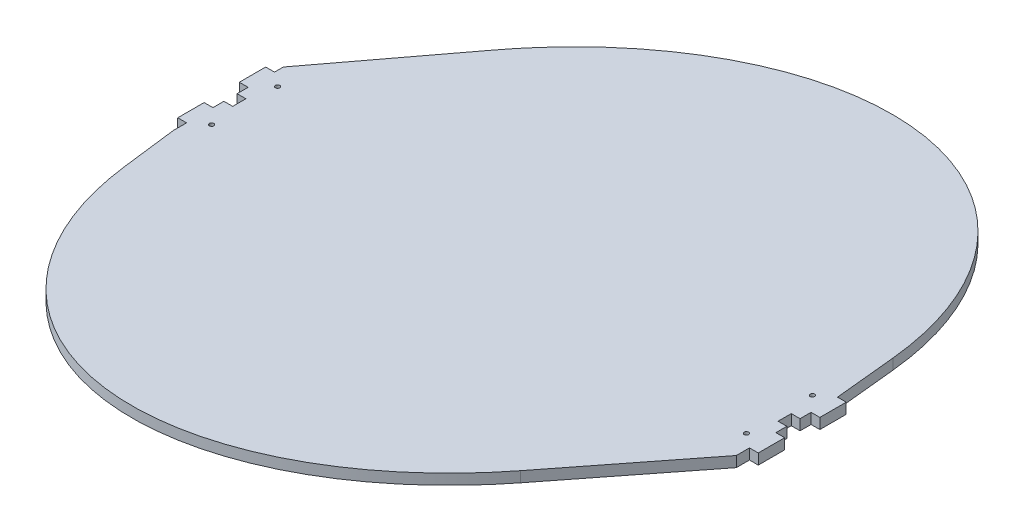
ISO-10303-21;
HEADER;
FILE_DESCRIPTION(('STEP AP214'),'2;1');
FILE_NAME('part.step','',(''),(''),'','','');
FILE_SCHEMA(('AUTOMOTIVE_DESIGN { 1 0 10303 214 1 1 1 1 }'));
ENDSEC;
DATA;
#1=APPLICATION_CONTEXT('core data for automotive mechanical design processes');
#2=APPLICATION_PROTOCOL_DEFINITION('international standard','automotive_design',2000,#1);
#3=PRODUCT_CONTEXT('',#1,'mechanical');
#4=PRODUCT('Part','Part','',(#3));
#5=PRODUCT_RELATED_PRODUCT_CATEGORY('part','',(#4));
#6=PRODUCT_DEFINITION_FORMATION('','',#4);
#7=PRODUCT_DEFINITION_CONTEXT('part definition',#1,'design');
#8=PRODUCT_DEFINITION('design','',#6,#7);
#9=PRODUCT_DEFINITION_SHAPE('','',#8);
#10=(LENGTH_UNIT() NAMED_UNIT(*) SI_UNIT(.MILLI.,.METRE.));
#11=(NAMED_UNIT(*) PLANE_ANGLE_UNIT() SI_UNIT($,.RADIAN.));
#12=(NAMED_UNIT(*) SI_UNIT($,.STERADIAN.) SOLID_ANGLE_UNIT());
#13=UNCERTAINTY_MEASURE_WITH_UNIT(LENGTH_MEASURE(1.E-05),#10,'distance_accuracy_value','');
#14=(GEOMETRIC_REPRESENTATION_CONTEXT(3) GLOBAL_UNCERTAINTY_ASSIGNED_CONTEXT((#13)) GLOBAL_UNIT_ASSIGNED_CONTEXT((#10,
#11,#12)) REPRESENTATION_CONTEXT('',''));
#15=CARTESIAN_POINT('',(0.,0.,0.));
#16=DIRECTION('',(0.,0.,1.));
#17=DIRECTION('',(1.,0.,0.));
#18=AXIS2_PLACEMENT_3D('',#15,#16,#17);
#19=CARTESIAN_POINT('',(-320.,12.,-19.9999999999999));
#20=DIRECTION('',(1.,0.,0.));
#21=DIRECTION('',(0.,0.,-1.));
#22=AXIS2_PLACEMENT_3D('',#19,#20,#21);
#23=PLANE('',#22);
#24=DIRECTION('',(0.,0.,1.));
#25=VECTOR('',#24,1.);
#26=CARTESIAN_POINT('',(-320.,0.,-19.9999999999999));
#27=LINE('',#26,#25);
#28=CARTESIAN_POINT('',(-320.,0.,-19.9999999999999));
#29=VERTEX_POINT('',#28);
#30=CARTESIAN_POINT('',(-320.,0.,-7.5));
#31=VERTEX_POINT('',#30);
#32=EDGE_CURVE('E420',#29,#31,#27,.T.);
#33=ORIENTED_EDGE('',*,*,#32,.T.);
#34=DIRECTION('',(0.,-1.,0.));
#35=VECTOR('',#34,1.);
#36=CARTESIAN_POINT('',(-320.,12.,-7.5));
#37=LINE('',#36,#35);
#38=CARTESIAN_POINT('',(-320.,12.,-7.5));
#39=VERTEX_POINT('',#38);
#40=EDGE_CURVE('E275',#39,#31,#37,.T.);
#41=ORIENTED_EDGE('',*,*,#40,.F.);
#42=DIRECTION('',(0.,0.,1.));
#43=VECTOR('',#42,1.);
#44=CARTESIAN_POINT('',(-320.,12.,-19.9999999999999));
#45=LINE('',#44,#43);
#46=CARTESIAN_POINT('',(-320.,12.,-19.9999999999999));
#47=VERTEX_POINT('',#46);
#48=EDGE_CURVE('E263',#47,#39,#45,.T.);
#49=ORIENTED_EDGE('',*,*,#48,.F.);
#50=DIRECTION('',(0.,-1.,0.));
#51=VECTOR('',#50,1.);
#52=CARTESIAN_POINT('',(-320.,12.,-19.9999999999999));
#53=LINE('',#52,#51);
#54=EDGE_CURVE('E436',#47,#29,#53,.T.);
#55=ORIENTED_EDGE('',*,*,#54,.T.);
#56=EDGE_LOOP('',(#33,#41,#49,#55));
#57=FACE_BOUND('',#56,.T.);
#58=ADVANCED_FACE('F33',(#57),#23,.F.);
#59=CARTESIAN_POINT('',(320.,12.,20.0000000000001));
#60=DIRECTION('',(-1.,0.,0.));
#61=DIRECTION('',(0.,0.,1.));
#62=AXIS2_PLACEMENT_3D('',#59,#60,#61);
#63=PLANE('',#62);
#64=DIRECTION('',(0.,0.,-1.));
#65=VECTOR('',#64,1.);
#66=CARTESIAN_POINT('',(320.,0.,20.0000000000001));
#67=LINE('',#66,#65);
#68=CARTESIAN_POINT('',(320.,0.,20.0000000000001));
#69=VERTEX_POINT('',#68);
#70=CARTESIAN_POINT('',(320.,0.,7.5));
#71=VERTEX_POINT('',#70);
#72=EDGE_CURVE('E394',#69,#71,#67,.T.);
#73=ORIENTED_EDGE('',*,*,#72,.T.);
#74=DIRECTION('',(0.,-1.,0.));
#75=VECTOR('',#74,1.);
#76=CARTESIAN_POINT('',(320.,12.,7.5));
#77=LINE('',#76,#75);
#78=CARTESIAN_POINT('',(320.,12.,7.5));
#79=VERTEX_POINT('',#78);
#80=EDGE_CURVE('E300',#79,#71,#77,.T.);
#81=ORIENTED_EDGE('',*,*,#80,.F.);
#82=DIRECTION('',(0.,0.,-1.));
#83=VECTOR('',#82,1.);
#84=CARTESIAN_POINT('',(320.,12.,20.0000000000001));
#85=LINE('',#84,#83);
#86=CARTESIAN_POINT('',(320.,12.,20.0000000000001));
#87=VERTEX_POINT('',#86);
#88=EDGE_CURVE('E598',#87,#79,#85,.T.);
#89=ORIENTED_EDGE('',*,*,#88,.F.);
#90=DIRECTION('',(0.,-1.,0.));
#91=VECTOR('',#90,1.);
#92=CARTESIAN_POINT('',(320.,12.,20.0000000000001));
#93=LINE('',#92,#91);
#94=EDGE_CURVE('E472',#87,#69,#93,.T.);
#95=ORIENTED_EDGE('',*,*,#94,.T.);
#96=EDGE_LOOP('',(#73,#81,#89,#95));
#97=FACE_BOUND('',#96,.T.);
#98=ADVANCED_FACE('F330',(#97),#63,.F.);
#99=CARTESIAN_POINT('',(-320.,12.,50.));
#100=DIRECTION('',(1.,0.,0.));
#101=DIRECTION('',(0.,0.,-1.));
#102=AXIS2_PLACEMENT_3D('',#99,#100,#101);
#103=PLANE('',#102);
#104=DIRECTION('',(0.,0.,1.));
#105=VECTOR('',#104,1.);
#106=CARTESIAN_POINT('',(-320.,0.,50.));
#107=LINE('',#106,#105);
#108=CARTESIAN_POINT('',(-320.,0.,50.));
#109=VERTEX_POINT('',#108);
#110=CARTESIAN_POINT('',(-320.,0.,65.));
#111=VERTEX_POINT('',#110);
#112=EDGE_CURVE('E299',#109,#111,#107,.T.);
#113=ORIENTED_EDGE('',*,*,#112,.T.);
#114=DIRECTION('',(0.,-1.,0.));
#115=VECTOR('',#114,1.);
#116=CARTESIAN_POINT('',(-320.,12.,65.));
#117=LINE('',#116,#115);
#118=CARTESIAN_POINT('',(-320.,12.,65.));
#119=VERTEX_POINT('',#118);
#120=EDGE_CURVE('E11',#119,#111,#117,.T.);
#121=ORIENTED_EDGE('',*,*,#120,.F.);
#122=DIRECTION('',(0.,0.,1.));
#123=VECTOR('',#122,1.);
#124=CARTESIAN_POINT('',(-320.,12.,50.));
#125=LINE('',#124,#123);
#126=CARTESIAN_POINT('',(-320.,12.,50.));
#127=VERTEX_POINT('',#126);
#128=EDGE_CURVE('E306',#127,#119,#125,.T.);
#129=ORIENTED_EDGE('',*,*,#128,.F.);
#130=DIRECTION('',(0.,-1.,0.));
#131=VECTOR('',#130,1.);
#132=CARTESIAN_POINT('',(-320.,12.,50.));
#133=LINE('',#132,#131);
#134=EDGE_CURVE('E376',#127,#109,#133,.T.);
#135=ORIENTED_EDGE('',*,*,#134,.T.);
#136=EDGE_LOOP('',(#113,#121,#129,#135));
#137=FACE_BOUND('',#136,.T.);
#138=ADVANCED_FACE('F35',(#137),#103,.F.);
#139=CARTESIAN_POINT('',(-320.,12.,65.));
#140=DIRECTION('',(0.992444869933192,0.,-0.122691402075649));
#141=DIRECTION('',(-0.122691402075649,0.,-0.992444869933193));
#142=AXIS2_PLACEMENT_3D('',#139,#140,#141);
#143=PLANE('',#142);
#144=DIRECTION('',(0.122691402075649,0.,0.992444869933192));
#145=VECTOR('',#144,1.);
#146=CARTESIAN_POINT('',(-320.,0.,65.));
#147=LINE('',#146,#145);
#148=CARTESIAN_POINT('',(-312.170159719471,0.,128.335202690207));
#149=VERTEX_POINT('',#148);
#150=EDGE_CURVE('E379',#111,#149,#147,.T.);
#151=ORIENTED_EDGE('',*,*,#150,.T.);
#152=DIRECTION('',(0.,-1.,0.));
#153=VECTOR('',#152,1.);
#154=CARTESIAN_POINT('',(-312.170159719471,12.,128.335202690207));
#155=LINE('',#154,#153);
#156=CARTESIAN_POINT('',(-312.170159719471,12.,128.335202690207));
#157=VERTEX_POINT('',#156);
#158=EDGE_CURVE('E42',#157,#149,#155,.T.);
#159=ORIENTED_EDGE('',*,*,#158,.F.);
#160=DIRECTION('',(0.122691402075649,0.,0.992444869933192));
#161=VECTOR('',#160,1.);
#162=CARTESIAN_POINT('',(-320.,12.,65.));
#163=LINE('',#162,#161);
#164=EDGE_CURVE('E309',#119,#157,#163,.T.);
#165=ORIENTED_EDGE('',*,*,#164,.F.);
#166=ORIENTED_EDGE('',*,*,#120,.T.);
#167=EDGE_LOOP('',(#151,#159,#165,#166));
#168=FACE_BOUND('',#167,.T.);
#169=ADVANCED_FACE('F322',(#168),#143,.F.);
#170=CARTESIAN_POINT('',(0.,12.,0.));
#171=DIRECTION('',(0.,1.,0.));
#172=DIRECTION('',(-0.5,0.,0.866025403784439));
#173=AXIS2_PLACEMENT_3D('',#170,#171,#172);
#174=ELLIPSE('',#173,380.,290.);
#175=DIRECTION('',(0.,-1.,0.));
#176=VECTOR('',#175,1.);
#177=SURFACE_OF_LINEAR_EXTRUSION('',#174,#176);
#178=CARTESIAN_POINT('',(0.,0.,0.));
#179=DIRECTION('',(0.,1.,0.));
#180=DIRECTION('',(-0.5,0.,0.866025403784439));
#181=AXIS2_PLACEMENT_3D('',#178,#179,#180);
#182=ELLIPSE('',#181,380.,290.);
#183=CARTESIAN_POINT('',(212.282149629902,0.,202.588475218978));
#184=VERTEX_POINT('',#183);
#185=EDGE_CURVE('E381',#149,#184,#182,.T.);
#186=ORIENTED_EDGE('',*,*,#185,.T.);
#187=DIRECTION('',(0.,-1.,0.));
#188=VECTOR('',#187,1.);
#189=CARTESIAN_POINT('',(212.282149629902,12.,202.588475218978));
#190=LINE('',#189,#188);
#191=CARTESIAN_POINT('',(212.282149629902,12.,202.588475218978));
#192=VERTEX_POINT('',#191);
#193=EDGE_CURVE('E487',#192,#184,#190,.T.);
#194=ORIENTED_EDGE('',*,*,#193,.F.);
#195=EDGE_CURVE('E312',#157,#192,#174,.T.);
#196=ORIENTED_EDGE('',*,*,#195,.F.);
#197=ORIENTED_EDGE('',*,*,#158,.T.);
#198=EDGE_LOOP('',(#186,#194,#196,#197));
#199=FACE_BOUND('',#198,.T.);
#200=ADVANCED_FACE('F318',(#199),#177,.F.);
#201=CARTESIAN_POINT('',(212.282149629902,12.,202.588475218978));
#202=DIRECTION('',(-0.787394127359223,0.,-0.616449907291913));
#203=DIRECTION('',(-0.616449907291913,0.,0.787394127359223));
#204=AXIS2_PLACEMENT_3D('',#201,#202,#203);
#205=PLANE('',#204);
#206=DIRECTION('',(0.616449907291913,0.,-0.787394127359223));
#207=VECTOR('',#206,1.);
#208=CARTESIAN_POINT('',(212.282149629902,0.,202.588475218978));
#209=LINE('',#208,#207);
#210=CARTESIAN_POINT('',(320.,0.,65.));
#211=VERTEX_POINT('',#210);
#212=EDGE_CURVE('E383',#184,#211,#209,.T.);
#213=ORIENTED_EDGE('',*,*,#212,.T.);
#214=DIRECTION('',(0.,-1.,0.));
#215=VECTOR('',#214,1.);
#216=CARTESIAN_POINT('',(320.,12.,65.));
#217=LINE('',#216,#215);
#218=CARTESIAN_POINT('',(320.,12.,65.));
#219=VERTEX_POINT('',#218);
#220=EDGE_CURVE('E484',#219,#211,#217,.T.);
#221=ORIENTED_EDGE('',*,*,#220,.F.);
#222=DIRECTION('',(0.616449907291913,0.,-0.787394127359223));
#223=VECTOR('',#222,1.);
#224=CARTESIAN_POINT('',(212.282149629902,12.,202.588475218978));
#225=LINE('',#224,#223);
#226=EDGE_CURVE('E315',#192,#219,#225,.T.);
#227=ORIENTED_EDGE('',*,*,#226,.F.);
#228=ORIENTED_EDGE('',*,*,#193,.T.);
#229=EDGE_LOOP('',(#213,#221,#227,#228));
#230=FACE_BOUND('',#229,.T.);
#231=ADVANCED_FACE('F321',(#230),#205,.F.);
#232=CARTESIAN_POINT('',(320.,12.,50.));
#233=DIRECTION('',(-1.,0.,0.));
#234=DIRECTION('',(0.,0.,1.));
#235=AXIS2_PLACEMENT_3D('',#232,#233,#234);
#236=PLANE('',#235);
#237=DIRECTION('',(0.,0.,-1.));
#238=VECTOR('',#237,1.);
#239=CARTESIAN_POINT('',(320.,0.,50.));
#240=LINE('',#239,#238);
#241=CARTESIAN_POINT('',(320.,0.,50.));
#242=VERTEX_POINT('',#241);
#243=EDGE_CURVE('E385',#211,#242,#240,.T.);
#244=ORIENTED_EDGE('',*,*,#243,.T.);
#245=DIRECTION('',(0.,-1.,0.));
#246=VECTOR('',#245,1.);
#247=CARTESIAN_POINT('',(320.,12.,50.));
#248=LINE('',#247,#246);
#249=CARTESIAN_POINT('',(320.,12.,50.));
#250=VERTEX_POINT('',#249);
#251=EDGE_CURVE('E481',#250,#242,#248,.T.);
#252=ORIENTED_EDGE('',*,*,#251,.F.);
#253=DIRECTION('',(0.,0.,-1.));
#254=VECTOR('',#253,1.);
#255=CARTESIAN_POINT('',(320.,12.,50.));
#256=LINE('',#255,#254);
#257=EDGE_CURVE('E588',#219,#250,#256,.T.);
#258=ORIENTED_EDGE('',*,*,#257,.F.);
#259=ORIENTED_EDGE('',*,*,#220,.T.);
#260=EDGE_LOOP('',(#244,#252,#258,#259));
#261=FACE_BOUND('',#260,.T.);
#262=ADVANCED_FACE('F656',(#261),#236,.F.);
#263=CARTESIAN_POINT('',(320.,12.,50.));
#264=DIRECTION('',(0.,0.,-1.));
#265=DIRECTION('',(-1.,0.,0.));
#266=AXIS2_PLACEMENT_3D('',#263,#264,#265);
#267=PLANE('',#266);
#268=DIRECTION('',(1.,0.,0.));
#269=VECTOR('',#268,1.);
#270=CARTESIAN_POINT('',(320.,0.,50.));
#271=LINE('',#270,#269);
#272=CARTESIAN_POINT('',(330.,0.,50.0000000000001));
#273=VERTEX_POINT('',#272);
#274=EDGE_CURVE('E387',#242,#273,#271,.T.);
#275=ORIENTED_EDGE('',*,*,#274,.T.);
#276=DIRECTION('',(0.,-1.,0.));
#277=VECTOR('',#276,1.);
#278=CARTESIAN_POINT('',(330.,12.,50.0000000000001));
#279=LINE('',#278,#277);
#280=CARTESIAN_POINT('',(330.,12.,50.0000000000001));
#281=VERTEX_POINT('',#280);
#282=EDGE_CURVE('E478',#281,#273,#279,.T.);
#283=ORIENTED_EDGE('',*,*,#282,.F.);
#284=DIRECTION('',(1.,0.,0.));
#285=VECTOR('',#284,1.);
#286=CARTESIAN_POINT('',(320.,12.,50.));
#287=LINE('',#286,#285);
#288=EDGE_CURVE('E589',#250,#281,#287,.T.);
#289=ORIENTED_EDGE('',*,*,#288,.F.);
#290=ORIENTED_EDGE('',*,*,#251,.T.);
#291=EDGE_LOOP('',(#275,#283,#289,#290));
#292=FACE_BOUND('',#291,.T.);
#293=ADVANCED_FACE('F653',(#292),#267,.F.);
#294=CARTESIAN_POINT('',(330.,12.,50.0000000000001));
#295=DIRECTION('',(-1.,0.,0.));
#296=DIRECTION('',(0.,0.,1.));
#297=AXIS2_PLACEMENT_3D('',#294,#295,#296);
#298=PLANE('',#297);
#299=DIRECTION('',(0.,0.,-1.));
#300=VECTOR('',#299,1.);
#301=CARTESIAN_POINT('',(330.,0.,50.0000000000001));
#302=LINE('',#301,#300);
#303=CARTESIAN_POINT('',(330.,0.,20.0000000000001));
#304=VERTEX_POINT('',#303);
#305=EDGE_CURVE('E389',#273,#304,#302,.T.);
#306=ORIENTED_EDGE('',*,*,#305,.T.);
#307=DIRECTION('',(0.,-1.,0.));
#308=VECTOR('',#307,1.);
#309=CARTESIAN_POINT('',(330.,12.,20.0000000000001));
#310=LINE('',#309,#308);
#311=CARTESIAN_POINT('',(330.,12.,20.0000000000001));
#312=VERTEX_POINT('',#311);
#313=EDGE_CURVE('E475',#312,#304,#310,.T.);
#314=ORIENTED_EDGE('',*,*,#313,.F.);
#315=DIRECTION('',(0.,0.,-1.));
#316=VECTOR('',#315,1.);
#317=CARTESIAN_POINT('',(330.,12.,50.0000000000001));
#318=LINE('',#317,#316);
#319=EDGE_CURVE('E591',#281,#312,#318,.T.);
#320=ORIENTED_EDGE('',*,*,#319,.F.);
#321=ORIENTED_EDGE('',*,*,#282,.T.);
#322=EDGE_LOOP('',(#306,#314,#320,#321));
#323=FACE_BOUND('',#322,.T.);
#324=ADVANCED_FACE('F649',(#323),#298,.F.);
#325=CARTESIAN_POINT('',(330.,12.,20.0000000000001));
#326=DIRECTION('',(0.,0.,1.));
#327=DIRECTION('',(1.,0.,0.));
#328=AXIS2_PLACEMENT_3D('',#325,#326,#327);
#329=PLANE('',#328);
#330=DIRECTION('',(-1.,0.,0.));
#331=VECTOR('',#330,1.);
#332=CARTESIAN_POINT('',(330.,0.,20.0000000000001));
#333=LINE('',#332,#331);
#334=EDGE_CURVE('E391',#304,#69,#333,.T.);
#335=ORIENTED_EDGE('',*,*,#334,.T.);
#336=ORIENTED_EDGE('',*,*,#94,.F.);
#337=DIRECTION('',(-1.,0.,0.));
#338=VECTOR('',#337,1.);
#339=CARTESIAN_POINT('',(330.,12.,20.0000000000001));
#340=LINE('',#339,#338);
#341=EDGE_CURVE('E595',#312,#87,#340,.T.);
#342=ORIENTED_EDGE('',*,*,#341,.F.);
#343=ORIENTED_EDGE('',*,*,#313,.T.);
#344=EDGE_LOOP('',(#335,#336,#342,#343));
#345=FACE_BOUND('',#344,.T.);
#346=ADVANCED_FACE('F645',(#345),#329,.F.);
#347=CARTESIAN_POINT('',(320.,12.,-7.5));
#348=VERTEX_POINT('',#347);
#349=CARTESIAN_POINT('',(320.,12.,-19.9999999999999));
#350=VERTEX_POINT('',#349);
#351=EDGE_CURVE('E597',#348,#350,#85,.T.);
#352=ORIENTED_EDGE('',*,*,#351,.F.);
#353=DIRECTION('',(0.,-1.,0.));
#354=VECTOR('',#353,1.);
#355=CARTESIAN_POINT('',(320.,12.,-7.5));
#356=LINE('',#355,#354);
#357=CARTESIAN_POINT('',(320.,0.,-7.5));
#358=VERTEX_POINT('',#357);
#359=EDGE_CURVE('E302',#348,#358,#356,.T.);
#360=ORIENTED_EDGE('',*,*,#359,.T.);
#361=CARTESIAN_POINT('',(320.,0.,-19.9999999999999));
#362=VERTEX_POINT('',#361);
#363=EDGE_CURVE('E393',#358,#362,#67,.T.);
#364=ORIENTED_EDGE('',*,*,#363,.T.);
#365=DIRECTION('',(0.,-1.,0.));
#366=VECTOR('',#365,1.);
#367=CARTESIAN_POINT('',(320.,12.,-19.9999999999999));
#368=LINE('',#367,#366);
#369=EDGE_CURVE('E469',#350,#362,#368,.T.);
#370=ORIENTED_EDGE('',*,*,#369,.F.);
#371=EDGE_LOOP('',(#352,#360,#364,#370));
#372=FACE_BOUND('',#371,.T.);
#373=ADVANCED_FACE('F341',(#372),#63,.F.);
#374=CARTESIAN_POINT('',(320.,12.,-19.9999999999999));
#375=DIRECTION('',(0.,0.,-1.));
#376=DIRECTION('',(-1.,0.,0.));
#377=AXIS2_PLACEMENT_3D('',#374,#375,#376);
#378=PLANE('',#377);
#379=DIRECTION('',(1.,0.,0.));
#380=VECTOR('',#379,1.);
#381=CARTESIAN_POINT('',(320.,0.,-19.9999999999999));
#382=LINE('',#381,#380);
#383=CARTESIAN_POINT('',(330.,0.,-19.9999999999999));
#384=VERTEX_POINT('',#383);
#385=EDGE_CURVE('E397',#362,#384,#382,.T.);
#386=ORIENTED_EDGE('',*,*,#385,.T.);
#387=DIRECTION('',(0.,-1.,0.));
#388=VECTOR('',#387,1.);
#389=CARTESIAN_POINT('',(330.,12.,-19.9999999999999));
#390=LINE('',#389,#388);
#391=CARTESIAN_POINT('',(330.,12.,-19.9999999999999));
#392=VERTEX_POINT('',#391);
#393=EDGE_CURVE('E466',#392,#384,#390,.T.);
#394=ORIENTED_EDGE('',*,*,#393,.F.);
#395=DIRECTION('',(1.,0.,0.));
#396=VECTOR('',#395,1.);
#397=CARTESIAN_POINT('',(320.,12.,-19.9999999999999));
#398=LINE('',#397,#396);
#399=EDGE_CURVE('E601',#350,#392,#398,.T.);
#400=ORIENTED_EDGE('',*,*,#399,.F.);
#401=ORIENTED_EDGE('',*,*,#369,.T.);
#402=EDGE_LOOP('',(#386,#394,#400,#401));
#403=FACE_BOUND('',#402,.T.);
#404=ADVANCED_FACE('F639',(#403),#378,.F.);
#405=CARTESIAN_POINT('',(330.,12.,-19.9999999999999));
#406=DIRECTION('',(-1.,0.,0.));
#407=DIRECTION('',(0.,0.,1.));
#408=AXIS2_PLACEMENT_3D('',#405,#406,#407);
#409=PLANE('',#408);
#410=DIRECTION('',(0.,0.,-1.));
#411=VECTOR('',#410,1.);
#412=CARTESIAN_POINT('',(330.,0.,-19.9999999999999));
#413=LINE('',#412,#411);
#414=CARTESIAN_POINT('',(330.,0.,-49.9999999999999));
#415=VERTEX_POINT('',#414);
#416=EDGE_CURVE('E399',#384,#415,#413,.T.);
#417=ORIENTED_EDGE('',*,*,#416,.T.);
#418=DIRECTION('',(0.,-1.,0.));
#419=VECTOR('',#418,1.);
#420=CARTESIAN_POINT('',(330.,12.,-49.9999999999999));
#421=LINE('',#420,#419);
#422=CARTESIAN_POINT('',(330.,12.,-49.9999999999999));
#423=VERTEX_POINT('',#422);
#424=EDGE_CURVE('E463',#423,#415,#421,.T.);
#425=ORIENTED_EDGE('',*,*,#424,.F.);
#426=DIRECTION('',(0.,0.,-1.));
#427=VECTOR('',#426,1.);
#428=CARTESIAN_POINT('',(330.,12.,-19.9999999999999));
#429=LINE('',#428,#427);
#430=EDGE_CURVE('E603',#392,#423,#429,.T.);
#431=ORIENTED_EDGE('',*,*,#430,.F.);
#432=ORIENTED_EDGE('',*,*,#393,.T.);
#433=EDGE_LOOP('',(#417,#425,#431,#432));
#434=FACE_BOUND('',#433,.T.);
#435=ADVANCED_FACE('F635',(#434),#409,.F.);
#436=CARTESIAN_POINT('',(330.,12.,-49.9999999999999));
#437=DIRECTION('',(0.,0.,1.));
#438=DIRECTION('',(1.,0.,0.));
#439=AXIS2_PLACEMENT_3D('',#436,#437,#438);
#440=PLANE('',#439);
#441=DIRECTION('',(-1.,0.,0.));
#442=VECTOR('',#441,1.);
#443=CARTESIAN_POINT('',(330.,0.,-49.9999999999999));
#444=LINE('',#443,#442);
#445=CARTESIAN_POINT('',(320.,0.,-49.9999999999999));
#446=VERTEX_POINT('',#445);
#447=EDGE_CURVE('E401',#415,#446,#444,.T.);
#448=ORIENTED_EDGE('',*,*,#447,.T.);
#449=DIRECTION('',(0.,-1.,0.));
#450=VECTOR('',#449,1.);
#451=CARTESIAN_POINT('',(320.,12.,-49.9999999999999));
#452=LINE('',#451,#450);
#453=CARTESIAN_POINT('',(320.,12.,-49.9999999999999));
#454=VERTEX_POINT('',#453);
#455=EDGE_CURVE('E460',#454,#446,#452,.T.);
#456=ORIENTED_EDGE('',*,*,#455,.F.);
#457=DIRECTION('',(-1.,0.,0.));
#458=VECTOR('',#457,1.);
#459=CARTESIAN_POINT('',(330.,12.,-49.9999999999999));
#460=LINE('',#459,#458);
#461=EDGE_CURVE('E605',#423,#454,#460,.T.);
#462=ORIENTED_EDGE('',*,*,#461,.F.);
#463=ORIENTED_EDGE('',*,*,#424,.T.);
#464=EDGE_LOOP('',(#448,#456,#462,#463));
#465=FACE_BOUND('',#464,.T.);
#466=ADVANCED_FACE('F631',(#465),#440,.F.);
#467=CARTESIAN_POINT('',(320.,12.,-49.9999999999999));
#468=DIRECTION('',(-1.,0.,2.22044604925031E-13));
#469=DIRECTION('',(2.22044604925031E-13,0.,1.));
#470=AXIS2_PLACEMENT_3D('',#467,#468,#469);
#471=PLANE('',#470);
#472=DIRECTION('',(-2.22044604925031E-13,0.,-1.));
#473=VECTOR('',#472,1.);
#474=CARTESIAN_POINT('',(320.,0.,-49.9999999999999));
#475=LINE('',#474,#473);
#476=CARTESIAN_POINT('',(319.999999999999,0.,-50.9999999999999));
#477=VERTEX_POINT('',#476);
#478=EDGE_CURVE('E403',#446,#477,#475,.T.);
#479=ORIENTED_EDGE('',*,*,#478,.T.);
#480=DIRECTION('',(0.,-1.,0.));
#481=VECTOR('',#480,1.);
#482=CARTESIAN_POINT('',(319.999999999999,12.,-50.9999999999999));
#483=LINE('',#482,#481);
#484=CARTESIAN_POINT('',(319.999999999999,12.,-50.9999999999999));
#485=VERTEX_POINT('',#484);
#486=EDGE_CURVE('E457',#485,#477,#483,.T.);
#487=ORIENTED_EDGE('',*,*,#486,.F.);
#488=DIRECTION('',(-2.22044604925031E-13,0.,-1.));
#489=VECTOR('',#488,1.);
#490=CARTESIAN_POINT('',(320.,12.,-49.9999999999999));
#491=LINE('',#490,#489);
#492=EDGE_CURVE('E607',#454,#485,#491,.T.);
#493=ORIENTED_EDGE('',*,*,#492,.F.);
#494=ORIENTED_EDGE('',*,*,#455,.T.);
#495=EDGE_LOOP('',(#479,#487,#493,#494));
#496=FACE_BOUND('',#495,.T.);
#497=ADVANCED_FACE('F627',(#496),#471,.F.);
#498=CARTESIAN_POINT('',(319.999999999999,12.,-50.9999999999999));
#499=DIRECTION('',(-0.995038008553335,0.,0.0994955352476276));
#500=DIRECTION('',(0.0994955352476277,0.,0.995038008553336));
#501=AXIS2_PLACEMENT_3D('',#498,#499,#500);
#502=PLANE('',#501);
#503=DIRECTION('',(-0.0994955352476277,0.,-0.995038008553336));
#504=VECTOR('',#503,1.);
#505=CARTESIAN_POINT('',(319.999999999999,0.,-50.9999999999999));
#506=LINE('',#505,#504);
#507=CARTESIAN_POINT('',(313.091302172236,0.,-120.092717689542));
#508=VERTEX_POINT('',#507);
#509=EDGE_CURVE('E405',#477,#508,#506,.T.);
#510=ORIENTED_EDGE('',*,*,#509,.T.);
#511=DIRECTION('',(0.,-1.,0.));
#512=VECTOR('',#511,1.);
#513=CARTESIAN_POINT('',(313.091302172236,12.,-120.092717689542));
#514=LINE('',#513,#512);
#515=CARTESIAN_POINT('',(313.091302172236,12.,-120.092717689542));
#516=VERTEX_POINT('',#515);
#517=EDGE_CURVE('E454',#516,#508,#514,.T.);
#518=ORIENTED_EDGE('',*,*,#517,.F.);
#519=DIRECTION('',(-0.0994955352476277,0.,-0.995038008553336));
#520=VECTOR('',#519,1.);
#521=CARTESIAN_POINT('',(319.999999999999,12.,-50.9999999999999));
#522=LINE('',#521,#520);
#523=EDGE_CURVE('E609',#485,#516,#522,.T.);
#524=ORIENTED_EDGE('',*,*,#523,.F.);
#525=ORIENTED_EDGE('',*,*,#486,.T.);
#526=EDGE_LOOP('',(#510,#518,#524,#525));
#527=FACE_BOUND('',#526,.T.);
#528=ADVANCED_FACE('F622',(#527),#502,.F.);
#529=CARTESIAN_POINT('',(0.,12.,0.));
#530=DIRECTION('',(0.,1.,0.));
#531=DIRECTION('',(-0.5,0.,0.866025403784439));
#532=AXIS2_PLACEMENT_3D('',#529,#530,#531);
#533=ELLIPSE('',#532,380.,290.);
#534=DIRECTION('',(0.,-1.,0.));
#535=VECTOR('',#534,1.);
#536=SURFACE_OF_LINEAR_EXTRUSION('',#533,#535);
#537=CARTESIAN_POINT('',(0.,0.,0.));
#538=DIRECTION('',(0.,1.,0.));
#539=DIRECTION('',(-0.5,0.,0.866025403784439));
#540=AXIS2_PLACEMENT_3D('',#537,#538,#539);
#541=ELLIPSE('',#540,380.,290.);
#542=CARTESIAN_POINT('',(-217.547896668045,0.,-195.73854520237));
#543=VERTEX_POINT('',#542);
#544=EDGE_CURVE('E407',#508,#543,#541,.T.);
#545=ORIENTED_EDGE('',*,*,#544,.T.);
#546=DIRECTION('',(0.,-1.,0.));
#547=VECTOR('',#546,1.);
#548=CARTESIAN_POINT('',(-217.547896668045,12.,-195.73854520237));
#549=LINE('',#548,#547);
#550=CARTESIAN_POINT('',(-217.547896668045,12.,-195.73854520237));
#551=VERTEX_POINT('',#550);
#552=EDGE_CURVE('E451',#551,#543,#549,.T.);
#553=ORIENTED_EDGE('',*,*,#552,.F.);
#554=EDGE_CURVE('E611',#516,#551,#533,.T.);
#555=ORIENTED_EDGE('',*,*,#554,.F.);
#556=ORIENTED_EDGE('',*,*,#517,.T.);
#557=EDGE_LOOP('',(#545,#553,#555,#556));
#558=FACE_BOUND('',#557,.T.);
#559=ADVANCED_FACE('F617',(#558),#536,.F.);
#560=CARTESIAN_POINT('',(-217.547896668045,12.,-195.73854520237));
#561=DIRECTION('',(0.798166761709125,0.,0.602436569692419));
#562=DIRECTION('',(0.602436569692419,0.,-0.798166761709125));
#563=AXIS2_PLACEMENT_3D('',#560,#561,#562);
#564=PLANE('',#563);
#565=DIRECTION('',(-0.602436569692419,0.,0.798166761709125));
#566=VECTOR('',#565,1.);
#567=CARTESIAN_POINT('',(-217.547896668045,0.,-195.73854520237));
#568=LINE('',#567,#566);
#569=CARTESIAN_POINT('',(-319.999999999999,0.,-60.));
#570=VERTEX_POINT('',#569);
#571=EDGE_CURVE('E409',#543,#570,#568,.T.);
#572=ORIENTED_EDGE('',*,*,#571,.T.);
#573=DIRECTION('',(0.,-1.,0.));
#574=VECTOR('',#573,1.);
#575=CARTESIAN_POINT('',(-319.999999999999,12.,-60.));
#576=LINE('',#575,#574);
#577=CARTESIAN_POINT('',(-319.999999999999,12.,-60.));
#578=VERTEX_POINT('',#577);
#579=EDGE_CURVE('E448',#578,#570,#576,.T.);
#580=ORIENTED_EDGE('',*,*,#579,.F.);
#581=DIRECTION('',(-0.602436569692419,0.,0.798166761709125));
#582=VECTOR('',#581,1.);
#583=CARTESIAN_POINT('',(-217.547896668045,12.,-195.73854520237));
#584=LINE('',#583,#582);
#585=EDGE_CURVE('E614',#551,#578,#584,.T.);
#586=ORIENTED_EDGE('',*,*,#585,.F.);
#587=ORIENTED_EDGE('',*,*,#552,.T.);
#588=EDGE_LOOP('',(#572,#580,#586,#587));
#589=FACE_BOUND('',#588,.T.);
#590=ADVANCED_FACE('F621',(#589),#564,.F.);
#591=CARTESIAN_POINT('',(-319.999999999999,12.,-60.));
#592=DIRECTION('',(1.,0.,0.));
#593=DIRECTION('',(0.,0.,-1.));
#594=AXIS2_PLACEMENT_3D('',#591,#592,#593);
#595=PLANE('',#594);
#596=DIRECTION('',(0.,0.,1.));
#597=VECTOR('',#596,1.);
#598=CARTESIAN_POINT('',(-319.999999999999,0.,-60.));
#599=LINE('',#598,#597);
#600=CARTESIAN_POINT('',(-320.,0.,-50.));
#601=VERTEX_POINT('',#600);
#602=EDGE_CURVE('E411',#570,#601,#599,.T.);
#603=ORIENTED_EDGE('',*,*,#602,.T.);
#604=DIRECTION('',(0.,-1.,0.));
#605=VECTOR('',#604,1.);
#606=CARTESIAN_POINT('',(-320.,12.,-50.));
#607=LINE('',#606,#605);
#608=CARTESIAN_POINT('',(-320.,12.,-50.));
#609=VERTEX_POINT('',#608);
#610=EDGE_CURVE('E445',#609,#601,#607,.T.);
#611=ORIENTED_EDGE('',*,*,#610,.F.);
#612=DIRECTION('',(0.,0.,1.));
#613=VECTOR('',#612,1.);
#614=CARTESIAN_POINT('',(-319.999999999999,12.,-60.));
#615=LINE('',#614,#613);
#616=EDGE_CURVE('E704',#578,#609,#615,.T.);
#617=ORIENTED_EDGE('',*,*,#616,.F.);
#618=ORIENTED_EDGE('',*,*,#579,.T.);
#619=EDGE_LOOP('',(#603,#611,#617,#618));
#620=FACE_BOUND('',#619,.T.);
#621=ADVANCED_FACE('F710',(#620),#595,.F.);
#622=CARTESIAN_POINT('',(-320.,12.,-50.));
#623=DIRECTION('',(0.,0.,1.));
#624=DIRECTION('',(1.,0.,0.));
#625=AXIS2_PLACEMENT_3D('',#622,#623,#624);
#626=PLANE('',#625);
#627=DIRECTION('',(-1.,0.,0.));
#628=VECTOR('',#627,1.);
#629=CARTESIAN_POINT('',(-320.,0.,-50.));
#630=LINE('',#629,#628);
#631=CARTESIAN_POINT('',(-330.,0.,-50.));
#632=VERTEX_POINT('',#631);
#633=EDGE_CURVE('E413',#601,#632,#630,.T.);
#634=ORIENTED_EDGE('',*,*,#633,.T.);
#635=DIRECTION('',(0.,-1.,0.));
#636=VECTOR('',#635,1.);
#637=CARTESIAN_POINT('',(-330.,12.,-50.));
#638=LINE('',#637,#636);
#639=CARTESIAN_POINT('',(-330.,12.,-50.));
#640=VERTEX_POINT('',#639);
#641=EDGE_CURVE('E442',#640,#632,#638,.T.);
#642=ORIENTED_EDGE('',*,*,#641,.F.);
#643=DIRECTION('',(-1.,0.,0.));
#644=VECTOR('',#643,1.);
#645=CARTESIAN_POINT('',(-320.,12.,-50.));
#646=LINE('',#645,#644);
#647=EDGE_CURVE('E712',#609,#640,#646,.T.);
#648=ORIENTED_EDGE('',*,*,#647,.F.);
#649=ORIENTED_EDGE('',*,*,#610,.T.);
#650=EDGE_LOOP('',(#634,#642,#648,#649));
#651=FACE_BOUND('',#650,.T.);
#652=ADVANCED_FACE('F724',(#651),#626,.F.);
#653=CARTESIAN_POINT('',(-330.,12.,-50.));
#654=DIRECTION('',(1.,0.,0.));
#655=DIRECTION('',(0.,0.,-1.));
#656=AXIS2_PLACEMENT_3D('',#653,#654,#655);
#657=PLANE('',#656);
#658=DIRECTION('',(0.,0.,1.));
#659=VECTOR('',#658,1.);
#660=CARTESIAN_POINT('',(-330.,0.,-50.));
#661=LINE('',#660,#659);
#662=CARTESIAN_POINT('',(-330.,0.,-19.9999999999999));
#663=VERTEX_POINT('',#662);
#664=EDGE_CURVE('E415',#632,#663,#661,.T.);
#665=ORIENTED_EDGE('',*,*,#664,.T.);
#666=DIRECTION('',(0.,-1.,0.));
#667=VECTOR('',#666,1.);
#668=CARTESIAN_POINT('',(-330.,12.,-19.9999999999999));
#669=LINE('',#668,#667);
#670=CARTESIAN_POINT('',(-330.,12.,-19.9999999999999));
#671=VERTEX_POINT('',#670);
#672=EDGE_CURVE('E439',#671,#663,#669,.T.);
#673=ORIENTED_EDGE('',*,*,#672,.F.);
#674=DIRECTION('',(0.,0.,1.));
#675=VECTOR('',#674,1.);
#676=CARTESIAN_POINT('',(-330.,12.,-50.));
#677=LINE('',#676,#675);
#678=EDGE_CURVE('E367',#640,#671,#677,.T.);
#679=ORIENTED_EDGE('',*,*,#678,.F.);
#680=ORIENTED_EDGE('',*,*,#641,.T.);
#681=EDGE_LOOP('',(#665,#673,#679,#680));
#682=FACE_BOUND('',#681,.T.);
#683=ADVANCED_FACE('F355',(#682),#657,.F.);
#684=CARTESIAN_POINT('',(-330.,12.,-19.9999999999999));
#685=DIRECTION('',(0.,0.,-1.));
#686=DIRECTION('',(-1.,0.,0.));
#687=AXIS2_PLACEMENT_3D('',#684,#685,#686);
#688=PLANE('',#687);
#689=DIRECTION('',(1.,0.,0.));
#690=VECTOR('',#689,1.);
#691=CARTESIAN_POINT('',(-330.,0.,-19.9999999999999));
#692=LINE('',#691,#690);
#693=EDGE_CURVE('E417',#663,#29,#692,.T.);
#694=ORIENTED_EDGE('',*,*,#693,.T.);
#695=ORIENTED_EDGE('',*,*,#54,.F.);
#696=DIRECTION('',(1.,0.,0.));
#697=VECTOR('',#696,1.);
#698=CARTESIAN_POINT('',(-330.,12.,-19.9999999999999));
#699=LINE('',#698,#697);
#700=EDGE_CURVE('E364',#671,#47,#699,.T.);
#701=ORIENTED_EDGE('',*,*,#700,.F.);
#702=ORIENTED_EDGE('',*,*,#672,.T.);
#703=EDGE_LOOP('',(#694,#695,#701,#702));
#704=FACE_BOUND('',#703,.T.);
#705=ADVANCED_FACE('F347',(#704),#688,.F.);
#706=CARTESIAN_POINT('',(-320.,12.,7.5));
#707=VERTEX_POINT('',#706);
#708=CARTESIAN_POINT('',(-320.,12.,20.0000000000001));
#709=VERTEX_POINT('',#708);
#710=EDGE_CURVE('E359',#707,#709,#45,.T.);
#711=ORIENTED_EDGE('',*,*,#710,.F.);
#712=DIRECTION('',(0.,-1.,0.));
#713=VECTOR('',#712,1.);
#714=CARTESIAN_POINT('',(-320.,12.,7.5));
#715=LINE('',#714,#713);
#716=CARTESIAN_POINT('',(-320.,0.,7.5));
#717=VERTEX_POINT('',#716);
#718=EDGE_CURVE('E277',#707,#717,#715,.T.);
#719=ORIENTED_EDGE('',*,*,#718,.T.);
#720=CARTESIAN_POINT('',(-320.,0.,20.0000000000001));
#721=VERTEX_POINT('',#720);
#722=EDGE_CURVE('E419',#717,#721,#27,.T.);
#723=ORIENTED_EDGE('',*,*,#722,.T.);
#724=DIRECTION('',(0.,-1.,0.));
#725=VECTOR('',#724,1.);
#726=CARTESIAN_POINT('',(-320.,12.,20.0000000000001));
#727=LINE('',#726,#725);
#728=EDGE_CURVE('E362',#709,#721,#727,.T.);
#729=ORIENTED_EDGE('',*,*,#728,.F.);
#730=EDGE_LOOP('',(#711,#719,#723,#729));
#731=FACE_BOUND('',#730,.T.);
#732=ADVANCED_FACE('F335',(#731),#23,.F.);
#733=CARTESIAN_POINT('',(-320.,12.,20.0000000000001));
#734=DIRECTION('',(0.,0.,1.));
#735=DIRECTION('',(1.,0.,0.));
#736=AXIS2_PLACEMENT_3D('',#733,#734,#735);
#737=PLANE('',#736);
#738=DIRECTION('',(-1.,0.,0.));
#739=VECTOR('',#738,1.);
#740=CARTESIAN_POINT('',(-320.,0.,20.0000000000001));
#741=LINE('',#740,#739);
#742=CARTESIAN_POINT('',(-330.,0.,20.0000000000001));
#743=VERTEX_POINT('',#742);
#744=EDGE_CURVE('E422',#721,#743,#741,.T.);
#745=ORIENTED_EDGE('',*,*,#744,.T.);
#746=DIRECTION('',(0.,-1.,0.));
#747=VECTOR('',#746,1.);
#748=CARTESIAN_POINT('',(-330.,12.,20.0000000000001));
#749=LINE('',#748,#747);
#750=CARTESIAN_POINT('',(-330.,12.,20.0000000000001));
#751=VERTEX_POINT('',#750);
#752=EDGE_CURVE('E432',#751,#743,#749,.T.);
#753=ORIENTED_EDGE('',*,*,#752,.F.);
#754=DIRECTION('',(-1.,0.,0.));
#755=VECTOR('',#754,1.);
#756=CARTESIAN_POINT('',(-320.,12.,20.0000000000001));
#757=LINE('',#756,#755);
#758=EDGE_CURVE('E366',#709,#751,#757,.T.);
#759=ORIENTED_EDGE('',*,*,#758,.F.);
#760=ORIENTED_EDGE('',*,*,#728,.T.);
#761=EDGE_LOOP('',(#745,#753,#759,#760));
#762=FACE_BOUND('',#761,.T.);
#763=ADVANCED_FACE('F346',(#762),#737,.F.);
#764=CARTESIAN_POINT('',(-330.,12.,20.0000000000001));
#765=DIRECTION('',(1.,0.,0.));
#766=DIRECTION('',(0.,0.,-1.));
#767=AXIS2_PLACEMENT_3D('',#764,#765,#766);
#768=PLANE('',#767);
#769=DIRECTION('',(0.,0.,1.));
#770=VECTOR('',#769,1.);
#771=CARTESIAN_POINT('',(-330.,0.,20.0000000000001));
#772=LINE('',#771,#770);
#773=CARTESIAN_POINT('',(-330.,0.,50.0000000000001));
#774=VERTEX_POINT('',#773);
#775=EDGE_CURVE('E424',#743,#774,#772,.T.);
#776=ORIENTED_EDGE('',*,*,#775,.T.);
#777=DIRECTION('',(0.,-1.,0.));
#778=VECTOR('',#777,1.);
#779=CARTESIAN_POINT('',(-330.,12.,50.0000000000001));
#780=LINE('',#779,#778);
#781=CARTESIAN_POINT('',(-330.,12.,50.0000000000001));
#782=VERTEX_POINT('',#781);
#783=EDGE_CURVE('E429',#782,#774,#780,.T.);
#784=ORIENTED_EDGE('',*,*,#783,.F.);
#785=DIRECTION('',(0.,0.,1.));
#786=VECTOR('',#785,1.);
#787=CARTESIAN_POINT('',(-330.,12.,20.0000000000001));
#788=LINE('',#787,#786);
#789=EDGE_CURVE('E372',#751,#782,#788,.T.);
#790=ORIENTED_EDGE('',*,*,#789,.F.);
#791=ORIENTED_EDGE('',*,*,#752,.T.);
#792=EDGE_LOOP('',(#776,#784,#790,#791));
#793=FACE_BOUND('',#792,.T.);
#794=ADVANCED_FACE('F353',(#793),#768,.F.);
#795=CARTESIAN_POINT('',(-330.,12.,50.0000000000001));
#796=DIRECTION('',(0.,0.,-1.));
#797=DIRECTION('',(-1.,0.,0.));
#798=AXIS2_PLACEMENT_3D('',#795,#796,#797);
#799=PLANE('',#798);
#800=DIRECTION('',(1.,0.,0.));
#801=VECTOR('',#800,1.);
#802=CARTESIAN_POINT('',(-330.,0.,50.0000000000001));
#803=LINE('',#802,#801);
#804=EDGE_CURVE('E310',#774,#109,#803,.T.);
#805=ORIENTED_EDGE('',*,*,#804,.T.);
#806=ORIENTED_EDGE('',*,*,#134,.F.);
#807=DIRECTION('',(1.,0.,0.));
#808=VECTOR('',#807,1.);
#809=CARTESIAN_POINT('',(-330.,12.,50.0000000000001));
#810=LINE('',#809,#808);
#811=EDGE_CURVE('E374',#782,#127,#810,.T.);
#812=ORIENTED_EDGE('',*,*,#811,.F.);
#813=ORIENTED_EDGE('',*,*,#783,.T.);
#814=EDGE_LOOP('',(#805,#806,#812,#813));
#815=FACE_BOUND('',#814,.T.);
#816=ADVANCED_FACE('F520',(#815),#799,.F.);
#817=CARTESIAN_POINT('',(0.,12.,0.));
#818=DIRECTION('',(0.,1.,0.));
#819=DIRECTION('',(0.,0.,1.));
#820=AXIS2_PLACEMENT_3D('',#817,#818,#819);
#821=PLANE('',#820);
#822=CARTESIAN_POINT('',(-304.,12.,-37.4999999999989));
#823=DIRECTION('',(0.,1.,0.));
#824=DIRECTION('',(0.,0.,1.));
#825=AXIS2_PLACEMENT_3D('',#822,#823,#824);
#826=CIRCLE('',#825,2.5);
#827=CARTESIAN_POINT('',(-304.,12.,-34.9999999999989));
#828=VERTEX_POINT('',#827);
#829=EDGE_CURVE('E501',#828,#828,#826,.T.);
#830=ORIENTED_EDGE('',*,*,#829,.F.);
#831=EDGE_LOOP('',(#830));
#832=FACE_BOUND('',#831,.T.);
#833=CARTESIAN_POINT('',(-303.999999999999,12.,37.5000000000011));
#834=DIRECTION('',(0.,1.,0.));
#835=DIRECTION('',(0.,0.,1.));
#836=AXIS2_PLACEMENT_3D('',#833,#834,#835);
#837=CIRCLE('',#836,2.5);
#838=CARTESIAN_POINT('',(-303.999999999999,12.,40.0000000000011));
#839=VERTEX_POINT('',#838);
#840=EDGE_CURVE('E498',#839,#839,#837,.T.);
#841=ORIENTED_EDGE('',*,*,#840,.F.);
#842=EDGE_LOOP('',(#841));
#843=FACE_BOUND('',#842,.T.);
#844=CARTESIAN_POINT('',(303.999999999999,12.,37.4999999999999));
#845=DIRECTION('',(0.,1.,0.));
#846=DIRECTION('',(0.,0.,1.));
#847=AXIS2_PLACEMENT_3D('',#844,#845,#846);
#848=CIRCLE('',#847,2.5);
#849=CARTESIAN_POINT('',(303.999999999999,12.,39.9999999999999));
#850=VERTEX_POINT('',#849);
#851=EDGE_CURVE('E495',#850,#850,#848,.T.);
#852=ORIENTED_EDGE('',*,*,#851,.F.);
#853=EDGE_LOOP('',(#852));
#854=FACE_BOUND('',#853,.T.);
#855=CARTESIAN_POINT('',(304.,12.,-37.5));
#856=DIRECTION('',(0.,1.,0.));
#857=DIRECTION('',(0.,0.,1.));
#858=AXIS2_PLACEMENT_3D('',#855,#856,#857);
#859=CIRCLE('',#858,2.5);
#860=CARTESIAN_POINT('',(304.,12.,-35.));
#861=VERTEX_POINT('',#860);
#862=EDGE_CURVE('E492',#861,#861,#859,.T.);
#863=ORIENTED_EDGE('',*,*,#862,.F.);
#864=EDGE_LOOP('',(#863));
#865=FACE_BOUND('',#864,.T.);
#866=DIRECTION('',(1.,0.,0.));
#867=VECTOR('',#866,1.);
#868=CARTESIAN_POINT('',(-320.,12.,-7.5));
#869=LINE('',#868,#867);
#870=CARTESIAN_POINT('',(-310.,12.,-7.5));
#871=VERTEX_POINT('',#870);
#872=EDGE_CURVE('E245',#39,#871,#869,.T.);
#873=ORIENTED_EDGE('',*,*,#872,.T.);
#874=DIRECTION('',(0.,0.,1.));
#875=VECTOR('',#874,1.);
#876=CARTESIAN_POINT('',(-310.,12.,-7.5));
#877=LINE('',#876,#875);
#878=CARTESIAN_POINT('',(-310.,12.,7.5));
#879=VERTEX_POINT('',#878);
#880=EDGE_CURVE('E254',#871,#879,#877,.T.);
#881=ORIENTED_EDGE('',*,*,#880,.T.);
#882=DIRECTION('',(-1.,0.,0.));
#883=VECTOR('',#882,1.);
#884=CARTESIAN_POINT('',(-320.,12.,7.5));
#885=LINE('',#884,#883);
#886=EDGE_CURVE('E251',#879,#707,#885,.T.);
#887=ORIENTED_EDGE('',*,*,#886,.T.);
#888=ORIENTED_EDGE('',*,*,#710,.T.);
#889=ORIENTED_EDGE('',*,*,#758,.T.);
#890=ORIENTED_EDGE('',*,*,#789,.T.);
#891=ORIENTED_EDGE('',*,*,#811,.T.);
#892=ORIENTED_EDGE('',*,*,#128,.T.);
#893=ORIENTED_EDGE('',*,*,#164,.T.);
#894=ORIENTED_EDGE('',*,*,#195,.T.);
#895=ORIENTED_EDGE('',*,*,#226,.T.);
#896=ORIENTED_EDGE('',*,*,#257,.T.);
#897=ORIENTED_EDGE('',*,*,#288,.T.);
#898=ORIENTED_EDGE('',*,*,#319,.T.);
#899=ORIENTED_EDGE('',*,*,#341,.T.);
#900=ORIENTED_EDGE('',*,*,#88,.T.);
#901=DIRECTION('',(-1.,0.,0.));
#902=VECTOR('',#901,1.);
#903=CARTESIAN_POINT('',(320.,12.,7.5));
#904=LINE('',#903,#902);
#905=CARTESIAN_POINT('',(310.,12.,7.5));
#906=VERTEX_POINT('',#905);
#907=EDGE_CURVE('E288',#79,#906,#904,.T.);
#908=ORIENTED_EDGE('',*,*,#907,.T.);
#909=DIRECTION('',(0.,0.,-1.));
#910=VECTOR('',#909,1.);
#911=CARTESIAN_POINT('',(310.,12.,-7.5));
#912=LINE('',#911,#910);
#913=CARTESIAN_POINT('',(310.,12.,-7.5));
#914=VERTEX_POINT('',#913);
#915=EDGE_CURVE('E281',#906,#914,#912,.T.);
#916=ORIENTED_EDGE('',*,*,#915,.T.);
#917=DIRECTION('',(1.,0.,0.));
#918=VECTOR('',#917,1.);
#919=CARTESIAN_POINT('',(320.,12.,-7.5));
#920=LINE('',#919,#918);
#921=EDGE_CURVE('E284',#914,#348,#920,.T.);
#922=ORIENTED_EDGE('',*,*,#921,.T.);
#923=ORIENTED_EDGE('',*,*,#351,.T.);
#924=ORIENTED_EDGE('',*,*,#399,.T.);
#925=ORIENTED_EDGE('',*,*,#430,.T.);
#926=ORIENTED_EDGE('',*,*,#461,.T.);
#927=ORIENTED_EDGE('',*,*,#492,.T.);
#928=ORIENTED_EDGE('',*,*,#523,.T.);
#929=ORIENTED_EDGE('',*,*,#554,.T.);
#930=ORIENTED_EDGE('',*,*,#585,.T.);
#931=ORIENTED_EDGE('',*,*,#616,.T.);
#932=ORIENTED_EDGE('',*,*,#647,.T.);
#933=ORIENTED_EDGE('',*,*,#678,.T.);
#934=ORIENTED_EDGE('',*,*,#700,.T.);
#935=ORIENTED_EDGE('',*,*,#48,.T.);
#936=EDGE_LOOP('',(#873,#881,#887,#888,#889,#890,#891,#892,#893,#894,#895,#896,#897,#898,#899,
#900,#908,#916,#922,#923,#924,#925,#926,#927,#928,#929,#930,#931,#932,#933,#934,#935));
#937=FACE_BOUND('',#936,.T.);
#938=ADVANCED_FACE('F261',(#832,#843,#854,#865,#937),#821,.T.);
#939=CARTESIAN_POINT('',(0.,0.,0.));
#940=DIRECTION('',(0.,1.,0.));
#941=DIRECTION('',(0.,0.,1.));
#942=AXIS2_PLACEMENT_3D('',#939,#940,#941);
#943=PLANE('',#942);
#944=CARTESIAN_POINT('',(-304.,0.,-37.4999999999989));
#945=DIRECTION('',(0.,1.,0.));
#946=DIRECTION('',(0.,0.,1.));
#947=AXIS2_PLACEMENT_3D('',#944,#945,#946);
#948=CIRCLE('',#947,2.5);
#949=CARTESIAN_POINT('',(-304.,0.,-34.9999999999989));
#950=VERTEX_POINT('',#949);
#951=EDGE_CURVE('E37',#950,#950,#948,.T.);
#952=ORIENTED_EDGE('',*,*,#951,.T.);
#953=EDGE_LOOP('',(#952));
#954=FACE_BOUND('',#953,.T.);
#955=CARTESIAN_POINT('',(-303.999999999999,0.,37.5000000000011));
#956=DIRECTION('',(0.,1.,0.));
#957=DIRECTION('',(0.,0.,1.));
#958=AXIS2_PLACEMENT_3D('',#955,#956,#957);
#959=CIRCLE('',#958,2.5);
#960=CARTESIAN_POINT('',(-303.999999999999,0.,40.0000000000011));
#961=VERTEX_POINT('',#960);
#962=EDGE_CURVE('E499',#961,#961,#959,.T.);
#963=ORIENTED_EDGE('',*,*,#962,.T.);
#964=EDGE_LOOP('',(#963));
#965=FACE_BOUND('',#964,.T.);
#966=CARTESIAN_POINT('',(303.999999999999,0.,37.4999999999999));
#967=DIRECTION('',(0.,1.,0.));
#968=DIRECTION('',(0.,0.,1.));
#969=AXIS2_PLACEMENT_3D('',#966,#967,#968);
#970=CIRCLE('',#969,2.5);
#971=CARTESIAN_POINT('',(303.999999999999,0.,39.9999999999999));
#972=VERTEX_POINT('',#971);
#973=EDGE_CURVE('E496',#972,#972,#970,.T.);
#974=ORIENTED_EDGE('',*,*,#973,.T.);
#975=EDGE_LOOP('',(#974));
#976=FACE_BOUND('',#975,.T.);
#977=CARTESIAN_POINT('',(304.,0.,-37.5));
#978=DIRECTION('',(0.,1.,0.));
#979=DIRECTION('',(0.,0.,1.));
#980=AXIS2_PLACEMENT_3D('',#977,#978,#979);
#981=CIRCLE('',#980,2.5);
#982=CARTESIAN_POINT('',(304.,0.,-35.));
#983=VERTEX_POINT('',#982);
#984=EDGE_CURVE('E269',#983,#983,#981,.T.);
#985=ORIENTED_EDGE('',*,*,#984,.T.);
#986=EDGE_LOOP('',(#985));
#987=FACE_BOUND('',#986,.T.);
#988=DIRECTION('',(0.,0.,1.));
#989=VECTOR('',#988,1.);
#990=CARTESIAN_POINT('',(-310.,0.,-7.5));
#991=LINE('',#990,#989);
#992=CARTESIAN_POINT('',(-310.,0.,-7.5));
#993=VERTEX_POINT('',#992);
#994=CARTESIAN_POINT('',(-310.,0.,7.5));
#995=VERTEX_POINT('',#994);
#996=EDGE_CURVE('E266',#993,#995,#991,.T.);
#997=ORIENTED_EDGE('',*,*,#996,.F.);
#998=DIRECTION('',(1.,0.,0.));
#999=VECTOR('',#998,1.);
#1000=CARTESIAN_POINT('',(-320.,0.,-7.5));
#1001=LINE('',#1000,#999);
#1002=EDGE_CURVE('E50',#31,#993,#1001,.T.);
#1003=ORIENTED_EDGE('',*,*,#1002,.F.);
#1004=ORIENTED_EDGE('',*,*,#32,.F.);
#1005=ORIENTED_EDGE('',*,*,#693,.F.);
#1006=ORIENTED_EDGE('',*,*,#664,.F.);
#1007=ORIENTED_EDGE('',*,*,#633,.F.);
#1008=ORIENTED_EDGE('',*,*,#602,.F.);
#1009=ORIENTED_EDGE('',*,*,#571,.F.);
#1010=ORIENTED_EDGE('',*,*,#544,.F.);
#1011=ORIENTED_EDGE('',*,*,#509,.F.);
#1012=ORIENTED_EDGE('',*,*,#478,.F.);
#1013=ORIENTED_EDGE('',*,*,#447,.F.);
#1014=ORIENTED_EDGE('',*,*,#416,.F.);
#1015=ORIENTED_EDGE('',*,*,#385,.F.);
#1016=ORIENTED_EDGE('',*,*,#363,.F.);
#1017=DIRECTION('',(1.,0.,0.));
#1018=VECTOR('',#1017,1.);
#1019=CARTESIAN_POINT('',(320.,0.,-7.5));
#1020=LINE('',#1019,#1018);
#1021=CARTESIAN_POINT('',(310.,0.,-7.5));
#1022=VERTEX_POINT('',#1021);
#1023=EDGE_CURVE('E293',#1022,#358,#1020,.T.);
#1024=ORIENTED_EDGE('',*,*,#1023,.F.);
#1025=DIRECTION('',(0.,0.,-1.));
#1026=VECTOR('',#1025,1.);
#1027=CARTESIAN_POINT('',(310.,0.,-7.5));
#1028=LINE('',#1027,#1026);
#1029=CARTESIAN_POINT('',(310.,0.,7.5));
#1030=VERTEX_POINT('',#1029);
#1031=EDGE_CURVE('E58',#1030,#1022,#1028,.T.);
#1032=ORIENTED_EDGE('',*,*,#1031,.F.);
#1033=DIRECTION('',(-1.,0.,0.));
#1034=VECTOR('',#1033,1.);
#1035=CARTESIAN_POINT('',(320.,0.,7.5));
#1036=LINE('',#1035,#1034);
#1037=EDGE_CURVE('E285',#71,#1030,#1036,.T.);
#1038=ORIENTED_EDGE('',*,*,#1037,.F.);
#1039=ORIENTED_EDGE('',*,*,#72,.F.);
#1040=ORIENTED_EDGE('',*,*,#334,.F.);
#1041=ORIENTED_EDGE('',*,*,#305,.F.);
#1042=ORIENTED_EDGE('',*,*,#274,.F.);
#1043=ORIENTED_EDGE('',*,*,#243,.F.);
#1044=ORIENTED_EDGE('',*,*,#212,.F.);
#1045=ORIENTED_EDGE('',*,*,#185,.F.);
#1046=ORIENTED_EDGE('',*,*,#150,.F.);
#1047=ORIENTED_EDGE('',*,*,#112,.F.);
#1048=ORIENTED_EDGE('',*,*,#804,.F.);
#1049=ORIENTED_EDGE('',*,*,#775,.F.);
#1050=ORIENTED_EDGE('',*,*,#744,.F.);
#1051=ORIENTED_EDGE('',*,*,#722,.F.);
#1052=DIRECTION('',(-1.,0.,0.));
#1053=VECTOR('',#1052,1.);
#1054=CARTESIAN_POINT('',(-320.,0.,7.5));
#1055=LINE('',#1054,#1053);
#1056=EDGE_CURVE('E264',#995,#717,#1055,.T.);
#1057=ORIENTED_EDGE('',*,*,#1056,.F.);
#1058=EDGE_LOOP('',(#997,#1003,#1004,#1005,#1006,#1007,#1008,#1009,#1010,#1011,#1012,#1013,
#1014,#1015,#1016,#1024,#1032,#1038,#1039,#1040,#1041,#1042,#1043,#1044,#1045,#1046,#1047,#1048,
#1049,#1050,#1051,#1057));
#1059=FACE_BOUND('',#1058,.T.);
#1060=ADVANCED_FACE('F519',(#954,#965,#976,#987,#1059),#943,.F.);
#1061=CARTESIAN_POINT('',(310.,12.,-7.5));
#1062=DIRECTION('',(-1.,0.,0.));
#1063=DIRECTION('',(0.,0.,1.));
#1064=AXIS2_PLACEMENT_3D('',#1061,#1062,#1063);
#1065=PLANE('',#1064);
#1066=ORIENTED_EDGE('',*,*,#1031,.T.);
#1067=DIRECTION('',(0.,-1.,0.));
#1068=VECTOR('',#1067,1.);
#1069=CARTESIAN_POINT('',(310.,12.,-7.5));
#1070=LINE('',#1069,#1068);
#1071=EDGE_CURVE('E291',#914,#1022,#1070,.T.);
#1072=ORIENTED_EDGE('',*,*,#1071,.F.);
#1073=ORIENTED_EDGE('',*,*,#915,.F.);
#1074=DIRECTION('',(0.,-1.,0.));
#1075=VECTOR('',#1074,1.);
#1076=CARTESIAN_POINT('',(310.,12.,7.5));
#1077=LINE('',#1076,#1075);
#1078=EDGE_CURVE('E297',#906,#1030,#1077,.T.);
#1079=ORIENTED_EDGE('',*,*,#1078,.T.);
#1080=EDGE_LOOP('',(#1066,#1072,#1073,#1079));
#1081=FACE_BOUND('',#1080,.T.);
#1082=ADVANCED_FACE('F534',(#1081),#1065,.F.);
#1083=CARTESIAN_POINT('',(320.,12.,7.5));
#1084=DIRECTION('',(0.,0.,1.));
#1085=DIRECTION('',(1.,0.,0.));
#1086=AXIS2_PLACEMENT_3D('',#1083,#1084,#1085);
#1087=PLANE('',#1086);
#1088=ORIENTED_EDGE('',*,*,#1037,.T.);
#1089=ORIENTED_EDGE('',*,*,#1078,.F.);
#1090=ORIENTED_EDGE('',*,*,#907,.F.);
#1091=ORIENTED_EDGE('',*,*,#80,.T.);
#1092=EDGE_LOOP('',(#1088,#1089,#1090,#1091));
#1093=FACE_BOUND('',#1092,.T.);
#1094=ADVANCED_FACE('F553',(#1093),#1087,.F.);
#1095=CARTESIAN_POINT('',(320.,12.,-7.5));
#1096=DIRECTION('',(0.,0.,-1.));
#1097=DIRECTION('',(-1.,0.,0.));
#1098=AXIS2_PLACEMENT_3D('',#1095,#1096,#1097);
#1099=PLANE('',#1098);
#1100=ORIENTED_EDGE('',*,*,#1023,.T.);
#1101=ORIENTED_EDGE('',*,*,#359,.F.);
#1102=ORIENTED_EDGE('',*,*,#921,.F.);
#1103=ORIENTED_EDGE('',*,*,#1071,.T.);
#1104=EDGE_LOOP('',(#1100,#1101,#1102,#1103));
#1105=FACE_BOUND('',#1104,.T.);
#1106=ADVANCED_FACE('F549',(#1105),#1099,.F.);
#1107=CARTESIAN_POINT('',(-320.,12.,-7.5));
#1108=DIRECTION('',(0.,0.,-1.));
#1109=DIRECTION('',(-1.,0.,0.));
#1110=AXIS2_PLACEMENT_3D('',#1107,#1108,#1109);
#1111=PLANE('',#1110);
#1112=ORIENTED_EDGE('',*,*,#1002,.T.);
#1113=DIRECTION('',(0.,-1.,0.));
#1114=VECTOR('',#1113,1.);
#1115=CARTESIAN_POINT('',(-310.,12.,-7.5));
#1116=LINE('',#1115,#1114);
#1117=EDGE_CURVE('E241',#871,#993,#1116,.T.);
#1118=ORIENTED_EDGE('',*,*,#1117,.F.);
#1119=ORIENTED_EDGE('',*,*,#872,.F.);
#1120=ORIENTED_EDGE('',*,*,#40,.T.);
#1121=EDGE_LOOP('',(#1112,#1118,#1119,#1120));
#1122=FACE_BOUND('',#1121,.T.);
#1123=ADVANCED_FACE('F243',(#1122),#1111,.F.);
#1124=CARTESIAN_POINT('',(-320.,12.,7.5));
#1125=DIRECTION('',(0.,0.,1.));
#1126=DIRECTION('',(1.,0.,0.));
#1127=AXIS2_PLACEMENT_3D('',#1124,#1125,#1126);
#1128=PLANE('',#1127);
#1129=ORIENTED_EDGE('',*,*,#1056,.T.);
#1130=ORIENTED_EDGE('',*,*,#718,.F.);
#1131=ORIENTED_EDGE('',*,*,#886,.F.);
#1132=DIRECTION('',(0.,-1.,0.));
#1133=VECTOR('',#1132,1.);
#1134=CARTESIAN_POINT('',(-310.,12.,7.5));
#1135=LINE('',#1134,#1133);
#1136=EDGE_CURVE('E250',#879,#995,#1135,.T.);
#1137=ORIENTED_EDGE('',*,*,#1136,.T.);
#1138=EDGE_LOOP('',(#1129,#1130,#1131,#1137));
#1139=FACE_BOUND('',#1138,.T.);
#1140=ADVANCED_FACE('F541',(#1139),#1128,.F.);
#1141=CARTESIAN_POINT('',(-310.,12.,-7.5));
#1142=DIRECTION('',(1.,0.,0.));
#1143=DIRECTION('',(0.,0.,-1.));
#1144=AXIS2_PLACEMENT_3D('',#1141,#1142,#1143);
#1145=PLANE('',#1144);
#1146=ORIENTED_EDGE('',*,*,#996,.T.);
#1147=ORIENTED_EDGE('',*,*,#1136,.F.);
#1148=ORIENTED_EDGE('',*,*,#880,.F.);
#1149=ORIENTED_EDGE('',*,*,#1117,.T.);
#1150=EDGE_LOOP('',(#1146,#1147,#1148,#1149));
#1151=FACE_BOUND('',#1150,.T.);
#1152=ADVANCED_FACE('F255',(#1151),#1145,.F.);
#1153=CARTESIAN_POINT('',(304.,-12.,-37.5));
#1154=DIRECTION('',(0.,-1.,0.));
#1155=DIRECTION('',(0.,0.,-1.));
#1156=AXIS2_PLACEMENT_3D('',#1153,#1154,#1155);
#1157=CYLINDRICAL_SURFACE('',#1156,2.5);
#1158=ORIENTED_EDGE('',*,*,#862,.T.);
#1159=EDGE_LOOP('',(#1158));
#1160=FACE_BOUND('',#1159,.T.);
#1161=ORIENTED_EDGE('',*,*,#984,.F.);
#1162=EDGE_LOOP('',(#1161));
#1163=FACE_BOUND('',#1162,.T.);
#1164=ADVANCED_FACE('F525',(#1160,#1163),#1157,.F.);
#1165=CARTESIAN_POINT('',(303.999999999999,-12.,37.4999999999999));
#1166=DIRECTION('',(0.,-1.,0.));
#1167=DIRECTION('',(0.,0.,-1.));
#1168=AXIS2_PLACEMENT_3D('',#1165,#1166,#1167);
#1169=CYLINDRICAL_SURFACE('',#1168,2.5);
#1170=ORIENTED_EDGE('',*,*,#851,.T.);
#1171=EDGE_LOOP('',(#1170));
#1172=FACE_BOUND('',#1171,.T.);
#1173=ORIENTED_EDGE('',*,*,#973,.F.);
#1174=EDGE_LOOP('',(#1173));
#1175=FACE_BOUND('',#1174,.T.);
#1176=ADVANCED_FACE('F514',(#1172,#1175),#1169,.F.);
#1177=CARTESIAN_POINT('',(-303.999999999999,-12.,37.5000000000011));
#1178=DIRECTION('',(0.,-1.,0.));
#1179=DIRECTION('',(0.,0.,-1.));
#1180=AXIS2_PLACEMENT_3D('',#1177,#1178,#1179);
#1181=CYLINDRICAL_SURFACE('',#1180,2.5);
#1182=ORIENTED_EDGE('',*,*,#840,.T.);
#1183=EDGE_LOOP('',(#1182));
#1184=FACE_BOUND('',#1183,.T.);
#1185=ORIENTED_EDGE('',*,*,#962,.F.);
#1186=EDGE_LOOP('',(#1185));
#1187=FACE_BOUND('',#1186,.T.);
#1188=ADVANCED_FACE('F934',(#1184,#1187),#1181,.F.);
#1189=CARTESIAN_POINT('',(-304.,-12.,-37.4999999999989));
#1190=DIRECTION('',(0.,-1.,0.));
#1191=DIRECTION('',(0.,0.,-1.));
#1192=AXIS2_PLACEMENT_3D('',#1189,#1190,#1191);
#1193=CYLINDRICAL_SURFACE('',#1192,2.5);
#1194=ORIENTED_EDGE('',*,*,#829,.T.);
#1195=EDGE_LOOP('',(#1194));
#1196=FACE_BOUND('',#1195,.T.);
#1197=ORIENTED_EDGE('',*,*,#951,.F.);
#1198=EDGE_LOOP('',(#1197));
#1199=FACE_BOUND('',#1198,.T.);
#1200=ADVANCED_FACE('F942',(#1196,#1199),#1193,.F.);
#1201=CLOSED_SHELL('',(#58,#98,#138,#169,#200,#231,#262,#293,#324,#346,#373,#404,#435,#466,#497,
#528,#559,#590,#621,#652,#683,#705,#732,#763,#794,#816,#938,#1060,#1082,#1094,#1106,#1123,#1140,
#1152,#1164,#1176,#1188,#1200));
#1202=MANIFOLD_SOLID_BREP('B2',#1201);
#1203=ADVANCED_BREP_SHAPE_REPRESENTATION('',(#18,#1202),#14);
#1204=SHAPE_DEFINITION_REPRESENTATION(#9,#1203);
ENDSEC;
END-ISO-10303-21;
